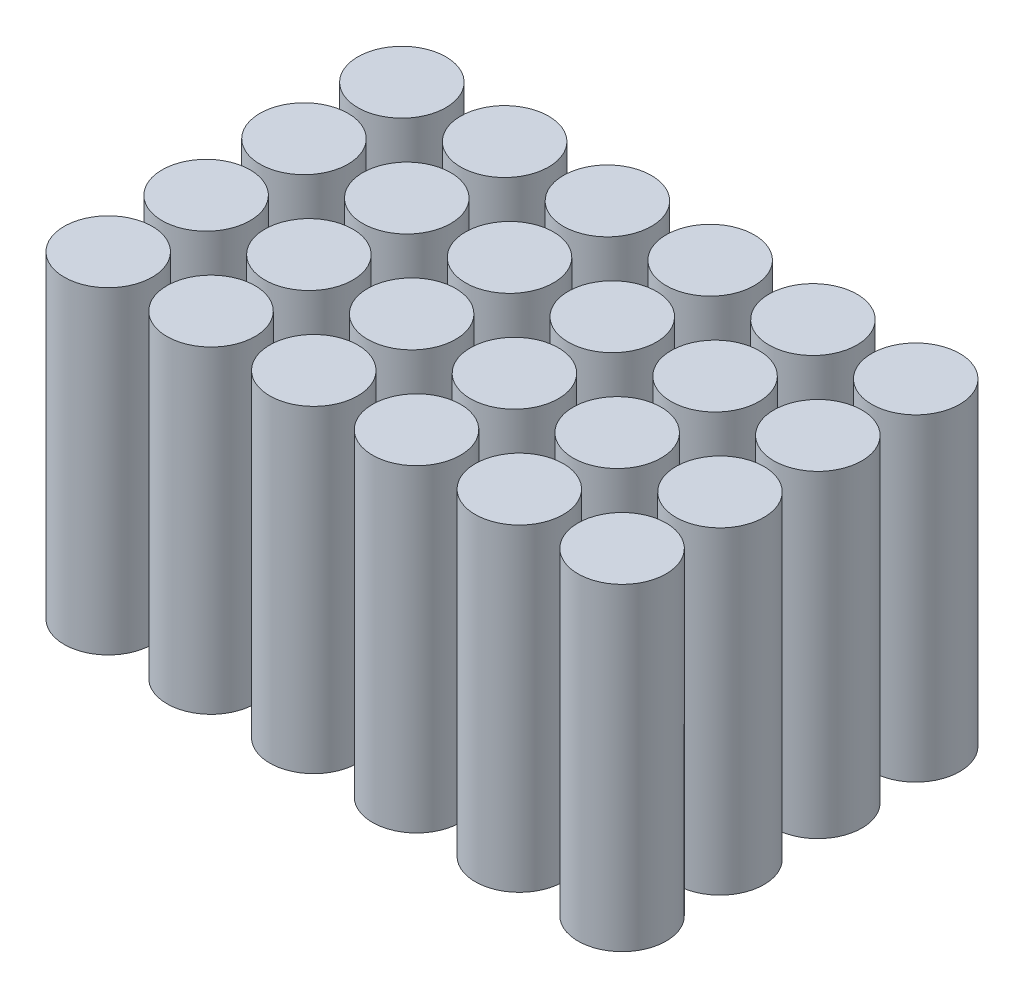
ISO-10303-21;
HEADER;
FILE_DESCRIPTION(('STEP AP214'),'2;1');
FILE_NAME('part.step','',(''),(''),'','','');
FILE_SCHEMA(('AUTOMOTIVE_DESIGN { 1 0 10303 214 1 1 1 1 }'));
ENDSEC;
DATA;
#1=APPLICATION_CONTEXT('core data for automotive mechanical design processes');
#2=APPLICATION_PROTOCOL_DEFINITION('international standard','automotive_design',2000,#1);
#3=PRODUCT_CONTEXT('',#1,'mechanical');
#4=PRODUCT('Part','Part','',(#3));
#5=PRODUCT_RELATED_PRODUCT_CATEGORY('part','',(#4));
#6=PRODUCT_DEFINITION_FORMATION('','',#4);
#7=PRODUCT_DEFINITION_CONTEXT('part definition',#1,'design');
#8=PRODUCT_DEFINITION('design','',#6,#7);
#9=PRODUCT_DEFINITION_SHAPE('','',#8);
#10=(LENGTH_UNIT() NAMED_UNIT(*) SI_UNIT(.MILLI.,.METRE.));
#11=(NAMED_UNIT(*) PLANE_ANGLE_UNIT() SI_UNIT($,.RADIAN.));
#12=(NAMED_UNIT(*) SI_UNIT($,.STERADIAN.) SOLID_ANGLE_UNIT());
#13=UNCERTAINTY_MEASURE_WITH_UNIT(LENGTH_MEASURE(1.E-05),#10,'distance_accuracy_value','');
#14=(GEOMETRIC_REPRESENTATION_CONTEXT(3) GLOBAL_UNCERTAINTY_ASSIGNED_CONTEXT((#13)) GLOBAL_UNIT_ASSIGNED_CONTEXT((#10,
#11,#12)) REPRESENTATION_CONTEXT('',''));
#15=CARTESIAN_POINT('',(0.,0.,0.));
#16=DIRECTION('',(0.,0.,1.));
#17=DIRECTION('',(1.,0.,0.));
#18=AXIS2_PLACEMENT_3D('',#15,#16,#17);
#19=CARTESIAN_POINT('',(-31.4999999999999,65.,-29.9999999999999));
#20=DIRECTION('',(0.,-1.,0.));
#21=DIRECTION('',(0.,0.,-1.));
#22=AXIS2_PLACEMENT_3D('',#19,#20,#21);
#23=CYLINDRICAL_SURFACE('',#22,9.00000000000001);
#24=CARTESIAN_POINT('',(-31.4999999999999,65.,-29.9999999999999));
#25=DIRECTION('',(0.,1.,0.));
#26=DIRECTION('',(0.,0.,-1.));
#27=AXIS2_PLACEMENT_3D('',#24,#25,#26);
#28=CIRCLE('',#27,9.00000000000001);
#29=CARTESIAN_POINT('',(-31.4999999999999,65.,-39.));
#30=VERTEX_POINT('',#29);
#31=EDGE_CURVE('E60',#30,#30,#28,.T.);
#32=ORIENTED_EDGE('',*,*,#31,.F.);
#33=EDGE_LOOP('',(#32));
#34=FACE_BOUND('',#33,.T.);
#35=CARTESIAN_POINT('',(-31.4999999999999,0.,-29.9999999999999));
#36=DIRECTION('',(0.,1.,0.));
#37=DIRECTION('',(0.,0.,-1.));
#38=AXIS2_PLACEMENT_3D('',#35,#36,#37);
#39=CIRCLE('',#38,9.00000000000001);
#40=CARTESIAN_POINT('',(-31.4999999999999,0.,-39.));
#41=VERTEX_POINT('',#40);
#42=EDGE_CURVE('E11',#41,#41,#39,.T.);
#43=ORIENTED_EDGE('',*,*,#42,.T.);
#44=EDGE_LOOP('',(#43));
#45=FACE_BOUND('',#44,.T.);
#46=ADVANCED_FACE('F56',(#34,#45),#23,.T.);
#47=CARTESIAN_POINT('',(-31.4999999999999,65.,-29.9999999999999));
#48=DIRECTION('',(0.,-1.,0.));
#49=DIRECTION('',(0.,0.,-1.));
#50=AXIS2_PLACEMENT_3D('',#47,#48,#49);
#51=PLANE('',#50);
#52=ORIENTED_EDGE('',*,*,#31,.T.);
#53=EDGE_LOOP('',(#52));
#54=FACE_BOUND('',#53,.T.);
#55=ADVANCED_FACE('F58',(#54),#51,.F.);
#56=CARTESIAN_POINT('',(-31.4999999999999,0.,-29.9999999999999));
#57=DIRECTION('',(0.,-1.,0.));
#58=DIRECTION('',(0.,0.,-1.));
#59=AXIS2_PLACEMENT_3D('',#56,#57,#58);
#60=PLANE('',#59);
#61=ORIENTED_EDGE('',*,*,#42,.F.);
#62=EDGE_LOOP('',(#61));
#63=FACE_BOUND('',#62,.T.);
#64=ADVANCED_FACE('F75',(#63),#60,.T.);
#65=CLOSED_SHELL('',(#46,#55,#64));
#66=MANIFOLD_SOLID_BREP('B2',#65);
#67=CARTESIAN_POINT('',(-31.4999999999999,65.,-9.99999999999997));
#68=DIRECTION('',(0.,-1.,0.));
#69=DIRECTION('',(0.,0.,-1.));
#70=AXIS2_PLACEMENT_3D('',#67,#68,#69);
#71=CYLINDRICAL_SURFACE('',#70,9.);
#72=CARTESIAN_POINT('',(-31.4999999999999,65.,-9.99999999999997));
#73=DIRECTION('',(0.,1.,0.));
#74=DIRECTION('',(0.,0.,-1.));
#75=AXIS2_PLACEMENT_3D('',#72,#73,#74);
#76=CIRCLE('',#75,9.);
#77=CARTESIAN_POINT('',(-31.4999999999999,65.,-19.));
#78=VERTEX_POINT('',#77);
#79=EDGE_CURVE('E122',#78,#78,#76,.T.);
#80=ORIENTED_EDGE('',*,*,#79,.F.);
#81=EDGE_LOOP('',(#80));
#82=FACE_BOUND('',#81,.T.);
#83=CARTESIAN_POINT('',(-31.4999999999999,0.,-9.99999999999997));
#84=DIRECTION('',(0.,1.,0.));
#85=DIRECTION('',(0.,0.,-1.));
#86=AXIS2_PLACEMENT_3D('',#83,#84,#85);
#87=CIRCLE('',#86,9.);
#88=CARTESIAN_POINT('',(-31.4999999999999,0.,-19.));
#89=VERTEX_POINT('',#88);
#90=EDGE_CURVE('E55',#89,#89,#87,.T.);
#91=ORIENTED_EDGE('',*,*,#90,.T.);
#92=EDGE_LOOP('',(#91));
#93=FACE_BOUND('',#92,.T.);
#94=ADVANCED_FACE('F118',(#82,#93),#71,.T.);
#95=CARTESIAN_POINT('',(-31.4999999999999,65.,-9.99999999999997));
#96=DIRECTION('',(0.,-1.,0.));
#97=DIRECTION('',(0.,0.,-1.));
#98=AXIS2_PLACEMENT_3D('',#95,#96,#97);
#99=PLANE('',#98);
#100=ORIENTED_EDGE('',*,*,#79,.T.);
#101=EDGE_LOOP('',(#100));
#102=FACE_BOUND('',#101,.T.);
#103=ADVANCED_FACE('F120',(#102),#99,.F.);
#104=CARTESIAN_POINT('',(-31.4999999999999,0.,-9.99999999999997));
#105=DIRECTION('',(0.,-1.,0.));
#106=DIRECTION('',(0.,0.,-1.));
#107=AXIS2_PLACEMENT_3D('',#104,#105,#106);
#108=PLANE('',#107);
#109=ORIENTED_EDGE('',*,*,#90,.F.);
#110=EDGE_LOOP('',(#109));
#111=FACE_BOUND('',#110,.T.);
#112=ADVANCED_FACE('F137',(#111),#108,.T.);
#113=CLOSED_SHELL('',(#94,#103,#112));
#114=MANIFOLD_SOLID_BREP('B6',#113);
#115=CARTESIAN_POINT('',(-31.5,65.,10.));
#116=DIRECTION('',(0.,-1.,0.));
#117=DIRECTION('',(0.,0.,-1.));
#118=AXIS2_PLACEMENT_3D('',#115,#116,#117);
#119=CYLINDRICAL_SURFACE('',#118,9.);
#120=CARTESIAN_POINT('',(-31.5,65.,10.));
#121=DIRECTION('',(0.,1.,0.));
#122=DIRECTION('',(0.,0.,-1.));
#123=AXIS2_PLACEMENT_3D('',#120,#121,#122);
#124=CIRCLE('',#123,9.);
#125=CARTESIAN_POINT('',(-31.5,65.,1.00000000000001));
#126=VERTEX_POINT('',#125);
#127=EDGE_CURVE('E184',#126,#126,#124,.T.);
#128=ORIENTED_EDGE('',*,*,#127,.F.);
#129=EDGE_LOOP('',(#128));
#130=FACE_BOUND('',#129,.T.);
#131=CARTESIAN_POINT('',(-31.5,0.,10.));
#132=DIRECTION('',(0.,1.,0.));
#133=DIRECTION('',(0.,0.,-1.));
#134=AXIS2_PLACEMENT_3D('',#131,#132,#133);
#135=CIRCLE('',#134,9.);
#136=CARTESIAN_POINT('',(-31.5,0.,1.00000000000001));
#137=VERTEX_POINT('',#136);
#138=EDGE_CURVE('E117',#137,#137,#135,.T.);
#139=ORIENTED_EDGE('',*,*,#138,.T.);
#140=EDGE_LOOP('',(#139));
#141=FACE_BOUND('',#140,.T.);
#142=ADVANCED_FACE('F180',(#130,#141),#119,.T.);
#143=CARTESIAN_POINT('',(-31.5,65.,10.));
#144=DIRECTION('',(0.,-1.,0.));
#145=DIRECTION('',(0.,0.,-1.));
#146=AXIS2_PLACEMENT_3D('',#143,#144,#145);
#147=PLANE('',#146);
#148=ORIENTED_EDGE('',*,*,#127,.T.);
#149=EDGE_LOOP('',(#148));
#150=FACE_BOUND('',#149,.T.);
#151=ADVANCED_FACE('F182',(#150),#147,.F.);
#152=CARTESIAN_POINT('',(-31.5,0.,10.));
#153=DIRECTION('',(0.,-1.,0.));
#154=DIRECTION('',(0.,0.,-1.));
#155=AXIS2_PLACEMENT_3D('',#152,#153,#154);
#156=PLANE('',#155);
#157=ORIENTED_EDGE('',*,*,#138,.F.);
#158=EDGE_LOOP('',(#157));
#159=FACE_BOUND('',#158,.T.);
#160=ADVANCED_FACE('F199',(#159),#156,.T.);
#161=CLOSED_SHELL('',(#142,#151,#160));
#162=MANIFOLD_SOLID_BREP('B50',#161);
#163=CARTESIAN_POINT('',(-31.4999999999999,65.,30.));
#164=DIRECTION('',(0.,-1.,0.));
#165=DIRECTION('',(0.,0.,-1.));
#166=AXIS2_PLACEMENT_3D('',#163,#164,#165);
#167=CYLINDRICAL_SURFACE('',#166,9.);
#168=CARTESIAN_POINT('',(-31.4999999999999,65.,30.));
#169=DIRECTION('',(0.,1.,0.));
#170=DIRECTION('',(0.,0.,1.));
#171=AXIS2_PLACEMENT_3D('',#168,#169,#170);
#172=CIRCLE('',#171,9.);
#173=CARTESIAN_POINT('',(-31.4999999999999,65.,39.));
#174=VERTEX_POINT('',#173);
#175=EDGE_CURVE('E246',#174,#174,#172,.T.);
#176=ORIENTED_EDGE('',*,*,#175,.F.);
#177=EDGE_LOOP('',(#176));
#178=FACE_BOUND('',#177,.T.);
#179=CARTESIAN_POINT('',(-31.4999999999999,0.,30.));
#180=DIRECTION('',(0.,1.,0.));
#181=DIRECTION('',(0.,0.,1.));
#182=AXIS2_PLACEMENT_3D('',#179,#180,#181);
#183=CIRCLE('',#182,9.);
#184=CARTESIAN_POINT('',(-31.4999999999999,0.,39.));
#185=VERTEX_POINT('',#184);
#186=EDGE_CURVE('E179',#185,#185,#183,.T.);
#187=ORIENTED_EDGE('',*,*,#186,.T.);
#188=EDGE_LOOP('',(#187));
#189=FACE_BOUND('',#188,.T.);
#190=ADVANCED_FACE('F242',(#178,#189),#167,.T.);
#191=CARTESIAN_POINT('',(-31.4999999999999,65.,30.));
#192=DIRECTION('',(0.,1.,0.));
#193=DIRECTION('',(0.,0.,1.));
#194=AXIS2_PLACEMENT_3D('',#191,#192,#193);
#195=PLANE('',#194);
#196=ORIENTED_EDGE('',*,*,#175,.T.);
#197=EDGE_LOOP('',(#196));
#198=FACE_BOUND('',#197,.T.);
#199=ADVANCED_FACE('F244',(#198),#195,.T.);
#200=CARTESIAN_POINT('',(-31.4999999999999,0.,30.));
#201=DIRECTION('',(0.,1.,0.));
#202=DIRECTION('',(0.,0.,1.));
#203=AXIS2_PLACEMENT_3D('',#200,#201,#202);
#204=PLANE('',#203);
#205=ORIENTED_EDGE('',*,*,#186,.F.);
#206=EDGE_LOOP('',(#205));
#207=FACE_BOUND('',#206,.T.);
#208=ADVANCED_FACE('F261',(#207),#204,.F.);
#209=CLOSED_SHELL('',(#190,#199,#208));
#210=MANIFOLD_SOLID_BREP('B112',#209);
#211=CARTESIAN_POINT('',(-52.4999999999999,65.,-29.9999999999999));
#212=DIRECTION('',(0.,-1.,0.));
#213=DIRECTION('',(0.,0.,-1.));
#214=AXIS2_PLACEMENT_3D('',#211,#212,#213);
#215=CYLINDRICAL_SURFACE('',#214,9.);
#216=CARTESIAN_POINT('',(-52.4999999999999,65.,-29.9999999999999));
#217=DIRECTION('',(0.,1.,0.));
#218=DIRECTION('',(0.,0.,-1.));
#219=AXIS2_PLACEMENT_3D('',#216,#217,#218);
#220=CIRCLE('',#219,9.);
#221=CARTESIAN_POINT('',(-52.4999999999999,65.,-38.9999999999999));
#222=VERTEX_POINT('',#221);
#223=EDGE_CURVE('E308',#222,#222,#220,.T.);
#224=ORIENTED_EDGE('',*,*,#223,.F.);
#225=EDGE_LOOP('',(#224));
#226=FACE_BOUND('',#225,.T.);
#227=CARTESIAN_POINT('',(-52.4999999999999,0.,-29.9999999999999));
#228=DIRECTION('',(0.,1.,0.));
#229=DIRECTION('',(0.,0.,-1.));
#230=AXIS2_PLACEMENT_3D('',#227,#228,#229);
#231=CIRCLE('',#230,9.);
#232=CARTESIAN_POINT('',(-52.4999999999999,0.,-38.9999999999999));
#233=VERTEX_POINT('',#232);
#234=EDGE_CURVE('E241',#233,#233,#231,.T.);
#235=ORIENTED_EDGE('',*,*,#234,.T.);
#236=EDGE_LOOP('',(#235));
#237=FACE_BOUND('',#236,.T.);
#238=ADVANCED_FACE('F304',(#226,#237),#215,.T.);
#239=CARTESIAN_POINT('',(-52.4999999999999,65.,-29.9999999999999));
#240=DIRECTION('',(0.,-1.,0.));
#241=DIRECTION('',(0.,0.,-1.));
#242=AXIS2_PLACEMENT_3D('',#239,#240,#241);
#243=PLANE('',#242);
#244=ORIENTED_EDGE('',*,*,#223,.T.);
#245=EDGE_LOOP('',(#244));
#246=FACE_BOUND('',#245,.T.);
#247=ADVANCED_FACE('F306',(#246),#243,.F.);
#248=CARTESIAN_POINT('',(-52.4999999999999,0.,-29.9999999999999));
#249=DIRECTION('',(0.,-1.,0.));
#250=DIRECTION('',(0.,0.,-1.));
#251=AXIS2_PLACEMENT_3D('',#248,#249,#250);
#252=PLANE('',#251);
#253=ORIENTED_EDGE('',*,*,#234,.F.);
#254=EDGE_LOOP('',(#253));
#255=FACE_BOUND('',#254,.T.);
#256=ADVANCED_FACE('F323',(#255),#252,.T.);
#257=CLOSED_SHELL('',(#238,#247,#256));
#258=MANIFOLD_SOLID_BREP('B174',#257);
#259=CARTESIAN_POINT('',(-52.4999999999999,65.,-9.99999999999997));
#260=DIRECTION('',(0.,-1.,0.));
#261=DIRECTION('',(0.,0.,-1.));
#262=AXIS2_PLACEMENT_3D('',#259,#260,#261);
#263=CYLINDRICAL_SURFACE('',#262,9.);
#264=CARTESIAN_POINT('',(-52.4999999999999,65.,-9.99999999999997));
#265=DIRECTION('',(0.,1.,0.));
#266=DIRECTION('',(0.,0.,-1.));
#267=AXIS2_PLACEMENT_3D('',#264,#265,#266);
#268=CIRCLE('',#267,9.);
#269=CARTESIAN_POINT('',(-52.4999999999999,65.,-19.));
#270=VERTEX_POINT('',#269);
#271=EDGE_CURVE('E370',#270,#270,#268,.T.);
#272=ORIENTED_EDGE('',*,*,#271,.F.);
#273=EDGE_LOOP('',(#272));
#274=FACE_BOUND('',#273,.T.);
#275=CARTESIAN_POINT('',(-52.4999999999999,0.,-9.99999999999997));
#276=DIRECTION('',(0.,1.,0.));
#277=DIRECTION('',(0.,0.,-1.));
#278=AXIS2_PLACEMENT_3D('',#275,#276,#277);
#279=CIRCLE('',#278,9.);
#280=CARTESIAN_POINT('',(-52.4999999999999,0.,-19.));
#281=VERTEX_POINT('',#280);
#282=EDGE_CURVE('E303',#281,#281,#279,.T.);
#283=ORIENTED_EDGE('',*,*,#282,.T.);
#284=EDGE_LOOP('',(#283));
#285=FACE_BOUND('',#284,.T.);
#286=ADVANCED_FACE('F366',(#274,#285),#263,.T.);
#287=CARTESIAN_POINT('',(-52.4999999999999,65.,-9.99999999999997));
#288=DIRECTION('',(0.,-1.,0.));
#289=DIRECTION('',(0.,0.,-1.));
#290=AXIS2_PLACEMENT_3D('',#287,#288,#289);
#291=PLANE('',#290);
#292=ORIENTED_EDGE('',*,*,#271,.T.);
#293=EDGE_LOOP('',(#292));
#294=FACE_BOUND('',#293,.T.);
#295=ADVANCED_FACE('F368',(#294),#291,.F.);
#296=CARTESIAN_POINT('',(-52.4999999999999,0.,-9.99999999999997));
#297=DIRECTION('',(0.,-1.,0.));
#298=DIRECTION('',(0.,0.,-1.));
#299=AXIS2_PLACEMENT_3D('',#296,#297,#298);
#300=PLANE('',#299);
#301=ORIENTED_EDGE('',*,*,#282,.F.);
#302=EDGE_LOOP('',(#301));
#303=FACE_BOUND('',#302,.T.);
#304=ADVANCED_FACE('F385',(#303),#300,.T.);
#305=CLOSED_SHELL('',(#286,#295,#304));
#306=MANIFOLD_SOLID_BREP('B236',#305);
#307=CARTESIAN_POINT('',(-52.5,65.,10.));
#308=DIRECTION('',(0.,-1.,0.));
#309=DIRECTION('',(0.,0.,-1.));
#310=AXIS2_PLACEMENT_3D('',#307,#308,#309);
#311=CYLINDRICAL_SURFACE('',#310,9.);
#312=CARTESIAN_POINT('',(-52.5,65.,10.));
#313=DIRECTION('',(0.,1.,0.));
#314=DIRECTION('',(0.,0.,-1.));
#315=AXIS2_PLACEMENT_3D('',#312,#313,#314);
#316=CIRCLE('',#315,9.);
#317=CARTESIAN_POINT('',(-52.5,65.,1.00000000000002));
#318=VERTEX_POINT('',#317);
#319=EDGE_CURVE('E432',#318,#318,#316,.T.);
#320=ORIENTED_EDGE('',*,*,#319,.F.);
#321=EDGE_LOOP('',(#320));
#322=FACE_BOUND('',#321,.T.);
#323=CARTESIAN_POINT('',(-52.5,0.,10.));
#324=DIRECTION('',(0.,1.,0.));
#325=DIRECTION('',(0.,0.,-1.));
#326=AXIS2_PLACEMENT_3D('',#323,#324,#325);
#327=CIRCLE('',#326,9.);
#328=CARTESIAN_POINT('',(-52.5,0.,1.00000000000002));
#329=VERTEX_POINT('',#328);
#330=EDGE_CURVE('E365',#329,#329,#327,.T.);
#331=ORIENTED_EDGE('',*,*,#330,.T.);
#332=EDGE_LOOP('',(#331));
#333=FACE_BOUND('',#332,.T.);
#334=ADVANCED_FACE('F428',(#322,#333),#311,.T.);
#335=CARTESIAN_POINT('',(-52.5,65.,10.));
#336=DIRECTION('',(0.,-1.,0.));
#337=DIRECTION('',(0.,0.,-1.));
#338=AXIS2_PLACEMENT_3D('',#335,#336,#337);
#339=PLANE('',#338);
#340=ORIENTED_EDGE('',*,*,#319,.T.);
#341=EDGE_LOOP('',(#340));
#342=FACE_BOUND('',#341,.T.);
#343=ADVANCED_FACE('F430',(#342),#339,.F.);
#344=CARTESIAN_POINT('',(-52.5,0.,10.));
#345=DIRECTION('',(0.,-1.,0.));
#346=DIRECTION('',(0.,0.,-1.));
#347=AXIS2_PLACEMENT_3D('',#344,#345,#346);
#348=PLANE('',#347);
#349=ORIENTED_EDGE('',*,*,#330,.F.);
#350=EDGE_LOOP('',(#349));
#351=FACE_BOUND('',#350,.T.);
#352=ADVANCED_FACE('F447',(#351),#348,.T.);
#353=CLOSED_SHELL('',(#334,#343,#352));
#354=MANIFOLD_SOLID_BREP('B298',#353);
#355=CARTESIAN_POINT('',(-52.4999999999999,65.,30.));
#356=DIRECTION('',(0.,-1.,0.));
#357=DIRECTION('',(0.,0.,-1.));
#358=AXIS2_PLACEMENT_3D('',#355,#356,#357);
#359=CYLINDRICAL_SURFACE('',#358,9.);
#360=CARTESIAN_POINT('',(-52.4999999999999,65.,30.));
#361=DIRECTION('',(0.,1.,0.));
#362=DIRECTION('',(0.,0.,1.));
#363=AXIS2_PLACEMENT_3D('',#360,#361,#362);
#364=CIRCLE('',#363,9.);
#365=CARTESIAN_POINT('',(-52.4999999999999,65.,39.));
#366=VERTEX_POINT('',#365);
#367=EDGE_CURVE('E494',#366,#366,#364,.T.);
#368=ORIENTED_EDGE('',*,*,#367,.F.);
#369=EDGE_LOOP('',(#368));
#370=FACE_BOUND('',#369,.T.);
#371=CARTESIAN_POINT('',(-52.4999999999999,0.,30.));
#372=DIRECTION('',(0.,1.,0.));
#373=DIRECTION('',(0.,0.,1.));
#374=AXIS2_PLACEMENT_3D('',#371,#372,#373);
#375=CIRCLE('',#374,9.);
#376=CARTESIAN_POINT('',(-52.4999999999999,0.,39.));
#377=VERTEX_POINT('',#376);
#378=EDGE_CURVE('E427',#377,#377,#375,.T.);
#379=ORIENTED_EDGE('',*,*,#378,.T.);
#380=EDGE_LOOP('',(#379));
#381=FACE_BOUND('',#380,.T.);
#382=ADVANCED_FACE('F490',(#370,#381),#359,.T.);
#383=CARTESIAN_POINT('',(-52.4999999999999,65.,30.));
#384=DIRECTION('',(0.,1.,0.));
#385=DIRECTION('',(0.,0.,1.));
#386=AXIS2_PLACEMENT_3D('',#383,#384,#385);
#387=PLANE('',#386);
#388=ORIENTED_EDGE('',*,*,#367,.T.);
#389=EDGE_LOOP('',(#388));
#390=FACE_BOUND('',#389,.T.);
#391=ADVANCED_FACE('F492',(#390),#387,.T.);
#392=CARTESIAN_POINT('',(-52.4999999999999,0.,30.));
#393=DIRECTION('',(0.,1.,0.));
#394=DIRECTION('',(0.,0.,1.));
#395=AXIS2_PLACEMENT_3D('',#392,#393,#394);
#396=PLANE('',#395);
#397=ORIENTED_EDGE('',*,*,#378,.F.);
#398=EDGE_LOOP('',(#397));
#399=FACE_BOUND('',#398,.T.);
#400=ADVANCED_FACE('F509',(#399),#396,.F.);
#401=CLOSED_SHELL('',(#382,#391,#400));
#402=MANIFOLD_SOLID_BREP('B360',#401);
#403=CARTESIAN_POINT('',(10.4999999999999,65.,30.));
#404=DIRECTION('',(0.,-1.,0.));
#405=DIRECTION('',(0.,0.,-1.));
#406=AXIS2_PLACEMENT_3D('',#403,#404,#405);
#407=CYLINDRICAL_SURFACE('',#406,9.00000000000001);
#408=CARTESIAN_POINT('',(10.4999999999999,65.,30.));
#409=DIRECTION('',(0.,1.,0.));
#410=DIRECTION('',(0.,0.,-1.));
#411=AXIS2_PLACEMENT_3D('',#408,#409,#410);
#412=CIRCLE('',#411,9.00000000000001);
#413=CARTESIAN_POINT('',(10.4999999999999,65.,21.));
#414=VERTEX_POINT('',#413);
#415=EDGE_CURVE('E556',#414,#414,#412,.T.);
#416=ORIENTED_EDGE('',*,*,#415,.F.);
#417=EDGE_LOOP('',(#416));
#418=FACE_BOUND('',#417,.T.);
#419=CARTESIAN_POINT('',(10.4999999999999,0.,30.));
#420=DIRECTION('',(0.,1.,0.));
#421=DIRECTION('',(0.,0.,-1.));
#422=AXIS2_PLACEMENT_3D('',#419,#420,#421);
#423=CIRCLE('',#422,9.00000000000001);
#424=CARTESIAN_POINT('',(10.4999999999999,0.,21.));
#425=VERTEX_POINT('',#424);
#426=EDGE_CURVE('E489',#425,#425,#423,.T.);
#427=ORIENTED_EDGE('',*,*,#426,.T.);
#428=EDGE_LOOP('',(#427));
#429=FACE_BOUND('',#428,.T.);
#430=ADVANCED_FACE('F552',(#418,#429),#407,.T.);
#431=CARTESIAN_POINT('',(10.4999999999999,65.,30.));
#432=DIRECTION('',(0.,-1.,0.));
#433=DIRECTION('',(0.,0.,-1.));
#434=AXIS2_PLACEMENT_3D('',#431,#432,#433);
#435=PLANE('',#434);
#436=ORIENTED_EDGE('',*,*,#415,.T.);
#437=EDGE_LOOP('',(#436));
#438=FACE_BOUND('',#437,.T.);
#439=ADVANCED_FACE('F554',(#438),#435,.F.);
#440=CARTESIAN_POINT('',(10.4999999999999,0.,30.));
#441=DIRECTION('',(0.,-1.,0.));
#442=DIRECTION('',(0.,0.,-1.));
#443=AXIS2_PLACEMENT_3D('',#440,#441,#442);
#444=PLANE('',#443);
#445=ORIENTED_EDGE('',*,*,#426,.F.);
#446=EDGE_LOOP('',(#445));
#447=FACE_BOUND('',#446,.T.);
#448=ADVANCED_FACE('F571',(#447),#444,.T.);
#449=CLOSED_SHELL('',(#430,#439,#448));
#450=MANIFOLD_SOLID_BREP('B422',#449);
#451=CARTESIAN_POINT('',(31.4999999999999,65.,30.));
#452=DIRECTION('',(0.,-1.,0.));
#453=DIRECTION('',(0.,0.,-1.));
#454=AXIS2_PLACEMENT_3D('',#451,#452,#453);
#455=CYLINDRICAL_SURFACE('',#454,9.00000000000001);
#456=CARTESIAN_POINT('',(31.4999999999999,65.,30.));
#457=DIRECTION('',(0.,1.,0.));
#458=DIRECTION('',(0.,0.,-1.));
#459=AXIS2_PLACEMENT_3D('',#456,#457,#458);
#460=CIRCLE('',#459,9.00000000000001);
#461=CARTESIAN_POINT('',(31.4999999999999,65.,21.));
#462=VERTEX_POINT('',#461);
#463=EDGE_CURVE('E619',#462,#462,#460,.T.);
#464=ORIENTED_EDGE('',*,*,#463,.F.);
#465=EDGE_LOOP('',(#464));
#466=FACE_BOUND('',#465,.T.);
#467=CARTESIAN_POINT('',(31.4999999999999,0.,30.));
#468=DIRECTION('',(0.,1.,0.));
#469=DIRECTION('',(0.,0.,-1.));
#470=AXIS2_PLACEMENT_3D('',#467,#468,#469);
#471=CIRCLE('',#470,9.00000000000001);
#472=CARTESIAN_POINT('',(31.4999999999999,0.,21.));
#473=VERTEX_POINT('',#472);
#474=EDGE_CURVE('E551',#473,#473,#471,.T.);
#475=ORIENTED_EDGE('',*,*,#474,.T.);
#476=EDGE_LOOP('',(#475));
#477=FACE_BOUND('',#476,.T.);
#478=ADVANCED_FACE('F615',(#466,#477),#455,.T.);
#479=CARTESIAN_POINT('',(31.4999999999999,65.,30.));
#480=DIRECTION('',(0.,-1.,0.));
#481=DIRECTION('',(0.,0.,-1.));
#482=AXIS2_PLACEMENT_3D('',#479,#480,#481);
#483=PLANE('',#482);
#484=ORIENTED_EDGE('',*,*,#463,.T.);
#485=EDGE_LOOP('',(#484));
#486=FACE_BOUND('',#485,.T.);
#487=ADVANCED_FACE('F617',(#486),#483,.F.);
#488=CARTESIAN_POINT('',(31.4999999999999,0.,30.));
#489=DIRECTION('',(0.,-1.,0.));
#490=DIRECTION('',(0.,0.,-1.));
#491=AXIS2_PLACEMENT_3D('',#488,#489,#490);
#492=PLANE('',#491);
#493=ORIENTED_EDGE('',*,*,#474,.F.);
#494=EDGE_LOOP('',(#493));
#495=FACE_BOUND('',#494,.T.);
#496=ADVANCED_FACE('F634',(#495),#492,.T.);
#497=CLOSED_SHELL('',(#478,#487,#496));
#498=MANIFOLD_SOLID_BREP('B484',#497);
#499=CARTESIAN_POINT('',(52.4999999999999,65.,30.));
#500=DIRECTION('',(0.,-1.,0.));
#501=DIRECTION('',(0.,0.,-1.));
#502=AXIS2_PLACEMENT_3D('',#499,#500,#501);
#503=CYLINDRICAL_SURFACE('',#502,9.);
#504=CARTESIAN_POINT('',(52.4999999999999,65.,30.));
#505=DIRECTION('',(0.,1.,0.));
#506=DIRECTION('',(0.,0.,-1.));
#507=AXIS2_PLACEMENT_3D('',#504,#505,#506);
#508=CIRCLE('',#507,9.);
#509=CARTESIAN_POINT('',(52.4999999999999,65.,21.));
#510=VERTEX_POINT('',#509);
#511=EDGE_CURVE('E682',#510,#510,#508,.T.);
#512=ORIENTED_EDGE('',*,*,#511,.F.);
#513=EDGE_LOOP('',(#512));
#514=FACE_BOUND('',#513,.T.);
#515=CARTESIAN_POINT('',(52.4999999999999,0.,30.));
#516=DIRECTION('',(0.,1.,0.));
#517=DIRECTION('',(0.,0.,-1.));
#518=AXIS2_PLACEMENT_3D('',#515,#516,#517);
#519=CIRCLE('',#518,9.);
#520=CARTESIAN_POINT('',(52.4999999999999,0.,21.));
#521=VERTEX_POINT('',#520);
#522=EDGE_CURVE('E614',#521,#521,#519,.T.);
#523=ORIENTED_EDGE('',*,*,#522,.T.);
#524=EDGE_LOOP('',(#523));
#525=FACE_BOUND('',#524,.T.);
#526=ADVANCED_FACE('F678',(#514,#525),#503,.T.);
#527=CARTESIAN_POINT('',(52.4999999999999,65.,30.));
#528=DIRECTION('',(0.,-1.,0.));
#529=DIRECTION('',(0.,0.,-1.));
#530=AXIS2_PLACEMENT_3D('',#527,#528,#529);
#531=PLANE('',#530);
#532=ORIENTED_EDGE('',*,*,#511,.T.);
#533=EDGE_LOOP('',(#532));
#534=FACE_BOUND('',#533,.T.);
#535=ADVANCED_FACE('F680',(#534),#531,.F.);
#536=CARTESIAN_POINT('',(52.4999999999999,0.,30.));
#537=DIRECTION('',(0.,-1.,0.));
#538=DIRECTION('',(0.,0.,-1.));
#539=AXIS2_PLACEMENT_3D('',#536,#537,#538);
#540=PLANE('',#539);
#541=ORIENTED_EDGE('',*,*,#522,.F.);
#542=EDGE_LOOP('',(#541));
#543=FACE_BOUND('',#542,.T.);
#544=ADVANCED_FACE('F698',(#543),#540,.T.);
#545=CLOSED_SHELL('',(#526,#535,#544));
#546=MANIFOLD_SOLID_BREP('B546',#545);
#547=CARTESIAN_POINT('',(-10.5000000000001,65.,-30.));
#548=DIRECTION('',(0.,-1.,0.));
#549=DIRECTION('',(0.,0.,-1.));
#550=AXIS2_PLACEMENT_3D('',#547,#548,#549);
#551=CYLINDRICAL_SURFACE('',#550,9.);
#552=CARTESIAN_POINT('',(-10.5000000000001,65.,-30.));
#553=DIRECTION('',(0.,1.,0.));
#554=DIRECTION('',(0.,0.,1.));
#555=AXIS2_PLACEMENT_3D('',#552,#553,#554);
#556=CIRCLE('',#555,9.);
#557=CARTESIAN_POINT('',(-10.5000000000001,65.,-21.));
#558=VERTEX_POINT('',#557);
#559=EDGE_CURVE('E745',#558,#558,#556,.T.);
#560=ORIENTED_EDGE('',*,*,#559,.F.);
#561=EDGE_LOOP('',(#560));
#562=FACE_BOUND('',#561,.T.);
#563=CARTESIAN_POINT('',(-10.5000000000001,0.,-30.));
#564=DIRECTION('',(0.,1.,0.));
#565=DIRECTION('',(0.,0.,1.));
#566=AXIS2_PLACEMENT_3D('',#563,#564,#565);
#567=CIRCLE('',#566,9.);
#568=CARTESIAN_POINT('',(-10.5000000000001,0.,-21.));
#569=VERTEX_POINT('',#568);
#570=EDGE_CURVE('E677',#569,#569,#567,.T.);
#571=ORIENTED_EDGE('',*,*,#570,.T.);
#572=EDGE_LOOP('',(#571));
#573=FACE_BOUND('',#572,.T.);
#574=ADVANCED_FACE('F741',(#562,#573),#551,.T.);
#575=CARTESIAN_POINT('',(-10.5000000000001,65.,-30.));
#576=DIRECTION('',(0.,1.,0.));
#577=DIRECTION('',(0.,0.,1.));
#578=AXIS2_PLACEMENT_3D('',#575,#576,#577);
#579=PLANE('',#578);
#580=ORIENTED_EDGE('',*,*,#559,.T.);
#581=EDGE_LOOP('',(#580));
#582=FACE_BOUND('',#581,.T.);
#583=ADVANCED_FACE('F743',(#582),#579,.T.);
#584=CARTESIAN_POINT('',(-10.5000000000001,0.,-30.));
#585=DIRECTION('',(0.,1.,0.));
#586=DIRECTION('',(0.,0.,1.));
#587=AXIS2_PLACEMENT_3D('',#584,#585,#586);
#588=PLANE('',#587);
#589=ORIENTED_EDGE('',*,*,#570,.F.);
#590=EDGE_LOOP('',(#589));
#591=FACE_BOUND('',#590,.T.);
#592=ADVANCED_FACE('F760',(#591),#588,.F.);
#593=CLOSED_SHELL('',(#574,#583,#592));
#594=MANIFOLD_SOLID_BREP('B609',#593);
#595=CARTESIAN_POINT('',(-10.5000000000001,65.,-10.));
#596=DIRECTION('',(0.,-1.,0.));
#597=DIRECTION('',(0.,0.,-1.));
#598=AXIS2_PLACEMENT_3D('',#595,#596,#597);
#599=CYLINDRICAL_SURFACE('',#598,9.);
#600=CARTESIAN_POINT('',(-10.5000000000001,65.,-10.));
#601=DIRECTION('',(0.,1.,0.));
#602=DIRECTION('',(0.,0.,1.));
#603=AXIS2_PLACEMENT_3D('',#600,#601,#602);
#604=CIRCLE('',#603,9.);
#605=CARTESIAN_POINT('',(-10.5000000000001,65.,-0.999999999999999));
#606=VERTEX_POINT('',#605);
#607=EDGE_CURVE('E807',#606,#606,#604,.T.);
#608=ORIENTED_EDGE('',*,*,#607,.F.);
#609=EDGE_LOOP('',(#608));
#610=FACE_BOUND('',#609,.T.);
#611=CARTESIAN_POINT('',(-10.5000000000001,0.,-10.));
#612=DIRECTION('',(0.,1.,0.));
#613=DIRECTION('',(0.,0.,1.));
#614=AXIS2_PLACEMENT_3D('',#611,#612,#613);
#615=CIRCLE('',#614,9.);
#616=CARTESIAN_POINT('',(-10.5000000000001,0.,-0.999999999999999));
#617=VERTEX_POINT('',#616);
#618=EDGE_CURVE('E740',#617,#617,#615,.T.);
#619=ORIENTED_EDGE('',*,*,#618,.T.);
#620=EDGE_LOOP('',(#619));
#621=FACE_BOUND('',#620,.T.);
#622=ADVANCED_FACE('F803',(#610,#621),#599,.T.);
#623=CARTESIAN_POINT('',(-10.5000000000001,65.,-10.));
#624=DIRECTION('',(0.,1.,0.));
#625=DIRECTION('',(0.,0.,1.));
#626=AXIS2_PLACEMENT_3D('',#623,#624,#625);
#627=PLANE('',#626);
#628=ORIENTED_EDGE('',*,*,#607,.T.);
#629=EDGE_LOOP('',(#628));
#630=FACE_BOUND('',#629,.T.);
#631=ADVANCED_FACE('F805',(#630),#627,.T.);
#632=CARTESIAN_POINT('',(-10.5000000000001,0.,-10.));
#633=DIRECTION('',(0.,1.,0.));
#634=DIRECTION('',(0.,0.,1.));
#635=AXIS2_PLACEMENT_3D('',#632,#633,#634);
#636=PLANE('',#635);
#637=ORIENTED_EDGE('',*,*,#618,.F.);
#638=EDGE_LOOP('',(#637));
#639=FACE_BOUND('',#638,.T.);
#640=ADVANCED_FACE('F822',(#639),#636,.F.);
#641=CLOSED_SHELL('',(#622,#631,#640));
#642=MANIFOLD_SOLID_BREP('B672',#641);
#643=CARTESIAN_POINT('',(52.4999999999999,65.,-30.));
#644=DIRECTION('',(0.,-1.,0.));
#645=DIRECTION('',(0.,0.,-1.));
#646=AXIS2_PLACEMENT_3D('',#643,#644,#645);
#647=CYLINDRICAL_SURFACE('',#646,9.);
#648=CARTESIAN_POINT('',(52.4999999999999,65.,-30.));
#649=DIRECTION('',(0.,1.,0.));
#650=DIRECTION('',(0.,0.,1.));
#651=AXIS2_PLACEMENT_3D('',#648,#649,#650);
#652=CIRCLE('',#651,9.);
#653=CARTESIAN_POINT('',(52.4999999999999,65.,-21.));
#654=VERTEX_POINT('',#653);
#655=EDGE_CURVE('E869',#654,#654,#652,.T.);
#656=ORIENTED_EDGE('',*,*,#655,.F.);
#657=EDGE_LOOP('',(#656));
#658=FACE_BOUND('',#657,.T.);
#659=CARTESIAN_POINT('',(52.4999999999999,0.,-30.));
#660=DIRECTION('',(0.,1.,0.));
#661=DIRECTION('',(0.,0.,1.));
#662=AXIS2_PLACEMENT_3D('',#659,#660,#661);
#663=CIRCLE('',#662,9.);
#664=CARTESIAN_POINT('',(52.4999999999999,0.,-21.));
#665=VERTEX_POINT('',#664);
#666=EDGE_CURVE('E802',#665,#665,#663,.T.);
#667=ORIENTED_EDGE('',*,*,#666,.T.);
#668=EDGE_LOOP('',(#667));
#669=FACE_BOUND('',#668,.T.);
#670=ADVANCED_FACE('F865',(#658,#669),#647,.T.);
#671=CARTESIAN_POINT('',(52.4999999999999,65.,-30.));
#672=DIRECTION('',(0.,1.,0.));
#673=DIRECTION('',(0.,0.,1.));
#674=AXIS2_PLACEMENT_3D('',#671,#672,#673);
#675=PLANE('',#674);
#676=ORIENTED_EDGE('',*,*,#655,.T.);
#677=EDGE_LOOP('',(#676));
#678=FACE_BOUND('',#677,.T.);
#679=ADVANCED_FACE('F867',(#678),#675,.T.);
#680=CARTESIAN_POINT('',(52.4999999999999,0.,-30.));
#681=DIRECTION('',(0.,1.,0.));
#682=DIRECTION('',(0.,0.,1.));
#683=AXIS2_PLACEMENT_3D('',#680,#681,#682);
#684=PLANE('',#683);
#685=ORIENTED_EDGE('',*,*,#666,.F.);
#686=EDGE_LOOP('',(#685));
#687=FACE_BOUND('',#686,.T.);
#688=ADVANCED_FACE('F884',(#687),#684,.F.);
#689=CLOSED_SHELL('',(#670,#679,#688));
#690=MANIFOLD_SOLID_BREP('B735',#689);
#691=CARTESIAN_POINT('',(31.4999999999999,65.,-30.));
#692=DIRECTION('',(0.,-1.,0.));
#693=DIRECTION('',(0.,0.,-1.));
#694=AXIS2_PLACEMENT_3D('',#691,#692,#693);
#695=CYLINDRICAL_SURFACE('',#694,9.00000000000001);
#696=CARTESIAN_POINT('',(31.4999999999999,65.,-30.));
#697=DIRECTION('',(0.,1.,0.));
#698=DIRECTION('',(0.,0.,1.));
#699=AXIS2_PLACEMENT_3D('',#696,#697,#698);
#700=CIRCLE('',#699,9.00000000000001);
#701=CARTESIAN_POINT('',(31.4999999999999,65.,-21.));
#702=VERTEX_POINT('',#701);
#703=EDGE_CURVE('E931',#702,#702,#700,.T.);
#704=ORIENTED_EDGE('',*,*,#703,.F.);
#705=EDGE_LOOP('',(#704));
#706=FACE_BOUND('',#705,.T.);
#707=CARTESIAN_POINT('',(31.4999999999999,0.,-30.));
#708=DIRECTION('',(0.,1.,0.));
#709=DIRECTION('',(0.,0.,1.));
#710=AXIS2_PLACEMENT_3D('',#707,#708,#709);
#711=CIRCLE('',#710,9.00000000000001);
#712=CARTESIAN_POINT('',(31.4999999999999,0.,-21.));
#713=VERTEX_POINT('',#712);
#714=EDGE_CURVE('E864',#713,#713,#711,.T.);
#715=ORIENTED_EDGE('',*,*,#714,.T.);
#716=EDGE_LOOP('',(#715));
#717=FACE_BOUND('',#716,.T.);
#718=ADVANCED_FACE('F927',(#706,#717),#695,.T.);
#719=CARTESIAN_POINT('',(31.4999999999999,65.,-30.));
#720=DIRECTION('',(0.,1.,0.));
#721=DIRECTION('',(0.,0.,1.));
#722=AXIS2_PLACEMENT_3D('',#719,#720,#721);
#723=PLANE('',#722);
#724=ORIENTED_EDGE('',*,*,#703,.T.);
#725=EDGE_LOOP('',(#724));
#726=FACE_BOUND('',#725,.T.);
#727=ADVANCED_FACE('F929',(#726),#723,.T.);
#728=CARTESIAN_POINT('',(31.4999999999999,0.,-30.));
#729=DIRECTION('',(0.,1.,0.));
#730=DIRECTION('',(0.,0.,1.));
#731=AXIS2_PLACEMENT_3D('',#728,#729,#730);
#732=PLANE('',#731);
#733=ORIENTED_EDGE('',*,*,#714,.F.);
#734=EDGE_LOOP('',(#733));
#735=FACE_BOUND('',#734,.T.);
#736=ADVANCED_FACE('F946',(#735),#732,.F.);
#737=CLOSED_SHELL('',(#718,#727,#736));
#738=MANIFOLD_SOLID_BREP('B797',#737);
#739=CARTESIAN_POINT('',(10.4999999999999,65.,-30.));
#740=DIRECTION('',(0.,-1.,0.));
#741=DIRECTION('',(0.,0.,-1.));
#742=AXIS2_PLACEMENT_3D('',#739,#740,#741);
#743=CYLINDRICAL_SURFACE('',#742,9.00000000000001);
#744=CARTESIAN_POINT('',(10.4999999999999,65.,-30.));
#745=DIRECTION('',(0.,1.,0.));
#746=DIRECTION('',(0.,0.,1.));
#747=AXIS2_PLACEMENT_3D('',#744,#745,#746);
#748=CIRCLE('',#747,9.00000000000001);
#749=CARTESIAN_POINT('',(10.4999999999999,65.,-21.));
#750=VERTEX_POINT('',#749);
#751=EDGE_CURVE('E993',#750,#750,#748,.T.);
#752=ORIENTED_EDGE('',*,*,#751,.F.);
#753=EDGE_LOOP('',(#752));
#754=FACE_BOUND('',#753,.T.);
#755=CARTESIAN_POINT('',(10.4999999999999,0.,-30.));
#756=DIRECTION('',(0.,1.,0.));
#757=DIRECTION('',(0.,0.,1.));
#758=AXIS2_PLACEMENT_3D('',#755,#756,#757);
#759=CIRCLE('',#758,9.00000000000001);
#760=CARTESIAN_POINT('',(10.4999999999999,0.,-21.));
#761=VERTEX_POINT('',#760);
#762=EDGE_CURVE('E926',#761,#761,#759,.T.);
#763=ORIENTED_EDGE('',*,*,#762,.T.);
#764=EDGE_LOOP('',(#763));
#765=FACE_BOUND('',#764,.T.);
#766=ADVANCED_FACE('F989',(#754,#765),#743,.T.);
#767=CARTESIAN_POINT('',(10.4999999999999,65.,-30.));
#768=DIRECTION('',(0.,1.,0.));
#769=DIRECTION('',(0.,0.,1.));
#770=AXIS2_PLACEMENT_3D('',#767,#768,#769);
#771=PLANE('',#770);
#772=ORIENTED_EDGE('',*,*,#751,.T.);
#773=EDGE_LOOP('',(#772));
#774=FACE_BOUND('',#773,.T.);
#775=ADVANCED_FACE('F991',(#774),#771,.T.);
#776=CARTESIAN_POINT('',(10.4999999999999,0.,-30.));
#777=DIRECTION('',(0.,1.,0.));
#778=DIRECTION('',(0.,0.,1.));
#779=AXIS2_PLACEMENT_3D('',#776,#777,#778);
#780=PLANE('',#779);
#781=ORIENTED_EDGE('',*,*,#762,.F.);
#782=EDGE_LOOP('',(#781));
#783=FACE_BOUND('',#782,.T.);
#784=ADVANCED_FACE('F1008',(#783),#780,.F.);
#785=CLOSED_SHELL('',(#766,#775,#784));
#786=MANIFOLD_SOLID_BREP('B859',#785);
#787=CARTESIAN_POINT('',(52.4999999999999,65.,-10.));
#788=DIRECTION('',(0.,-1.,0.));
#789=DIRECTION('',(0.,0.,-1.));
#790=AXIS2_PLACEMENT_3D('',#787,#788,#789);
#791=CYLINDRICAL_SURFACE('',#790,9.);
#792=CARTESIAN_POINT('',(52.4999999999999,65.,-10.));
#793=DIRECTION('',(0.,1.,0.));
#794=DIRECTION('',(0.,0.,1.));
#795=AXIS2_PLACEMENT_3D('',#792,#793,#794);
#796=CIRCLE('',#795,9.);
#797=CARTESIAN_POINT('',(52.4999999999999,65.,-1.00000000000001));
#798=VERTEX_POINT('',#797);
#799=EDGE_CURVE('E1055',#798,#798,#796,.T.);
#800=ORIENTED_EDGE('',*,*,#799,.F.);
#801=EDGE_LOOP('',(#800));
#802=FACE_BOUND('',#801,.T.);
#803=CARTESIAN_POINT('',(52.4999999999999,0.,-10.));
#804=DIRECTION('',(0.,1.,0.));
#805=DIRECTION('',(0.,0.,1.));
#806=AXIS2_PLACEMENT_3D('',#803,#804,#805);
#807=CIRCLE('',#806,9.);
#808=CARTESIAN_POINT('',(52.4999999999999,0.,-1.00000000000001));
#809=VERTEX_POINT('',#808);
#810=EDGE_CURVE('E988',#809,#809,#807,.T.);
#811=ORIENTED_EDGE('',*,*,#810,.T.);
#812=EDGE_LOOP('',(#811));
#813=FACE_BOUND('',#812,.T.);
#814=ADVANCED_FACE('F1051',(#802,#813),#791,.T.);
#815=CARTESIAN_POINT('',(52.4999999999999,65.,-10.));
#816=DIRECTION('',(0.,1.,0.));
#817=DIRECTION('',(0.,0.,1.));
#818=AXIS2_PLACEMENT_3D('',#815,#816,#817);
#819=PLANE('',#818);
#820=ORIENTED_EDGE('',*,*,#799,.T.);
#821=EDGE_LOOP('',(#820));
#822=FACE_BOUND('',#821,.T.);
#823=ADVANCED_FACE('F1053',(#822),#819,.T.);
#824=CARTESIAN_POINT('',(52.4999999999999,0.,-10.));
#825=DIRECTION('',(0.,1.,0.));
#826=DIRECTION('',(0.,0.,1.));
#827=AXIS2_PLACEMENT_3D('',#824,#825,#826);
#828=PLANE('',#827);
#829=ORIENTED_EDGE('',*,*,#810,.F.);
#830=EDGE_LOOP('',(#829));
#831=FACE_BOUND('',#830,.T.);
#832=ADVANCED_FACE('F1070',(#831),#828,.F.);
#833=CLOSED_SHELL('',(#814,#823,#832));
#834=MANIFOLD_SOLID_BREP('B921',#833);
#835=CARTESIAN_POINT('',(31.4999999999999,65.,-10.));
#836=DIRECTION('',(0.,-1.,0.));
#837=DIRECTION('',(0.,0.,-1.));
#838=AXIS2_PLACEMENT_3D('',#835,#836,#837);
#839=CYLINDRICAL_SURFACE('',#838,9.);
#840=CARTESIAN_POINT('',(31.4999999999999,65.,-10.));
#841=DIRECTION('',(0.,1.,0.));
#842=DIRECTION('',(0.,0.,1.));
#843=AXIS2_PLACEMENT_3D('',#840,#841,#842);
#844=CIRCLE('',#843,9.);
#845=CARTESIAN_POINT('',(31.4999999999999,65.,-0.999999999999999));
#846=VERTEX_POINT('',#845);
#847=EDGE_CURVE('E1117',#846,#846,#844,.T.);
#848=ORIENTED_EDGE('',*,*,#847,.F.);
#849=EDGE_LOOP('',(#848));
#850=FACE_BOUND('',#849,.T.);
#851=CARTESIAN_POINT('',(31.4999999999999,0.,-10.));
#852=DIRECTION('',(0.,1.,0.));
#853=DIRECTION('',(0.,0.,1.));
#854=AXIS2_PLACEMENT_3D('',#851,#852,#853);
#855=CIRCLE('',#854,9.);
#856=CARTESIAN_POINT('',(31.4999999999999,0.,-0.999999999999999));
#857=VERTEX_POINT('',#856);
#858=EDGE_CURVE('E1050',#857,#857,#855,.T.);
#859=ORIENTED_EDGE('',*,*,#858,.T.);
#860=EDGE_LOOP('',(#859));
#861=FACE_BOUND('',#860,.T.);
#862=ADVANCED_FACE('F1113',(#850,#861),#839,.T.);
#863=CARTESIAN_POINT('',(31.4999999999999,65.,-10.));
#864=DIRECTION('',(0.,1.,0.));
#865=DIRECTION('',(0.,0.,1.));
#866=AXIS2_PLACEMENT_3D('',#863,#864,#865);
#867=PLANE('',#866);
#868=ORIENTED_EDGE('',*,*,#847,.T.);
#869=EDGE_LOOP('',(#868));
#870=FACE_BOUND('',#869,.T.);
#871=ADVANCED_FACE('F1115',(#870),#867,.T.);
#872=CARTESIAN_POINT('',(31.4999999999999,0.,-10.));
#873=DIRECTION('',(0.,1.,0.));
#874=DIRECTION('',(0.,0.,1.));
#875=AXIS2_PLACEMENT_3D('',#872,#873,#874);
#876=PLANE('',#875);
#877=ORIENTED_EDGE('',*,*,#858,.F.);
#878=EDGE_LOOP('',(#877));
#879=FACE_BOUND('',#878,.T.);
#880=ADVANCED_FACE('F1132',(#879),#876,.F.);
#881=CLOSED_SHELL('',(#862,#871,#880));
#882=MANIFOLD_SOLID_BREP('B983',#881);
#883=CARTESIAN_POINT('',(10.4999999999999,65.,-10.));
#884=DIRECTION('',(0.,-1.,0.));
#885=DIRECTION('',(0.,0.,-1.));
#886=AXIS2_PLACEMENT_3D('',#883,#884,#885);
#887=CYLINDRICAL_SURFACE('',#886,9.);
#888=CARTESIAN_POINT('',(10.4999999999999,65.,-10.));
#889=DIRECTION('',(0.,1.,0.));
#890=DIRECTION('',(0.,0.,1.));
#891=AXIS2_PLACEMENT_3D('',#888,#889,#890);
#892=CIRCLE('',#891,9.);
#893=CARTESIAN_POINT('',(10.4999999999999,65.,-0.999999999999999));
#894=VERTEX_POINT('',#893);
#895=EDGE_CURVE('E1179',#894,#894,#892,.T.);
#896=ORIENTED_EDGE('',*,*,#895,.F.);
#897=EDGE_LOOP('',(#896));
#898=FACE_BOUND('',#897,.T.);
#899=CARTESIAN_POINT('',(10.4999999999999,0.,-10.));
#900=DIRECTION('',(0.,1.,0.));
#901=DIRECTION('',(0.,0.,1.));
#902=AXIS2_PLACEMENT_3D('',#899,#900,#901);
#903=CIRCLE('',#902,9.);
#904=CARTESIAN_POINT('',(10.4999999999999,0.,-0.999999999999999));
#905=VERTEX_POINT('',#904);
#906=EDGE_CURVE('E1112',#905,#905,#903,.T.);
#907=ORIENTED_EDGE('',*,*,#906,.T.);
#908=EDGE_LOOP('',(#907));
#909=FACE_BOUND('',#908,.T.);
#910=ADVANCED_FACE('F1175',(#898,#909),#887,.T.);
#911=CARTESIAN_POINT('',(10.4999999999999,65.,-10.));
#912=DIRECTION('',(0.,1.,0.));
#913=DIRECTION('',(0.,0.,1.));
#914=AXIS2_PLACEMENT_3D('',#911,#912,#913);
#915=PLANE('',#914);
#916=ORIENTED_EDGE('',*,*,#895,.T.);
#917=EDGE_LOOP('',(#916));
#918=FACE_BOUND('',#917,.T.);
#919=ADVANCED_FACE('F1177',(#918),#915,.T.);
#920=CARTESIAN_POINT('',(10.4999999999999,0.,-10.));
#921=DIRECTION('',(0.,1.,0.));
#922=DIRECTION('',(0.,0.,1.));
#923=AXIS2_PLACEMENT_3D('',#920,#921,#922);
#924=PLANE('',#923);
#925=ORIENTED_EDGE('',*,*,#906,.F.);
#926=EDGE_LOOP('',(#925));
#927=FACE_BOUND('',#926,.T.);
#928=ADVANCED_FACE('F1194',(#927),#924,.F.);
#929=CLOSED_SHELL('',(#910,#919,#928));
#930=MANIFOLD_SOLID_BREP('B1045',#929);
#931=CARTESIAN_POINT('',(52.5,65.,10.));
#932=DIRECTION('',(0.,-1.,0.));
#933=DIRECTION('',(0.,0.,-1.));
#934=AXIS2_PLACEMENT_3D('',#931,#932,#933);
#935=CYLINDRICAL_SURFACE('',#934,9.);
#936=CARTESIAN_POINT('',(52.5,65.,10.));
#937=DIRECTION('',(0.,1.,0.));
#938=DIRECTION('',(0.,0.,1.));
#939=AXIS2_PLACEMENT_3D('',#936,#937,#938);
#940=CIRCLE('',#939,9.);
#941=CARTESIAN_POINT('',(52.5,65.,19.));
#942=VERTEX_POINT('',#941);
#943=EDGE_CURVE('E1241',#942,#942,#940,.T.);
#944=ORIENTED_EDGE('',*,*,#943,.F.);
#945=EDGE_LOOP('',(#944));
#946=FACE_BOUND('',#945,.T.);
#947=CARTESIAN_POINT('',(52.5,0.,10.));
#948=DIRECTION('',(0.,1.,0.));
#949=DIRECTION('',(0.,0.,1.));
#950=AXIS2_PLACEMENT_3D('',#947,#948,#949);
#951=CIRCLE('',#950,9.);
#952=CARTESIAN_POINT('',(52.5,0.,19.));
#953=VERTEX_POINT('',#952);
#954=EDGE_CURVE('E1174',#953,#953,#951,.T.);
#955=ORIENTED_EDGE('',*,*,#954,.T.);
#956=EDGE_LOOP('',(#955));
#957=FACE_BOUND('',#956,.T.);
#958=ADVANCED_FACE('F1237',(#946,#957),#935,.T.);
#959=CARTESIAN_POINT('',(52.5,65.,10.));
#960=DIRECTION('',(0.,1.,0.));
#961=DIRECTION('',(0.,0.,1.));
#962=AXIS2_PLACEMENT_3D('',#959,#960,#961);
#963=PLANE('',#962);
#964=ORIENTED_EDGE('',*,*,#943,.T.);
#965=EDGE_LOOP('',(#964));
#966=FACE_BOUND('',#965,.T.);
#967=ADVANCED_FACE('F1239',(#966),#963,.T.);
#968=CARTESIAN_POINT('',(52.5,0.,10.));
#969=DIRECTION('',(0.,1.,0.));
#970=DIRECTION('',(0.,0.,1.));
#971=AXIS2_PLACEMENT_3D('',#968,#969,#970);
#972=PLANE('',#971);
#973=ORIENTED_EDGE('',*,*,#954,.F.);
#974=EDGE_LOOP('',(#973));
#975=FACE_BOUND('',#974,.T.);
#976=ADVANCED_FACE('F1256',(#975),#972,.F.);
#977=CLOSED_SHELL('',(#958,#967,#976));
#978=MANIFOLD_SOLID_BREP('B1107',#977);
#979=CARTESIAN_POINT('',(31.5,65.,10.));
#980=DIRECTION('',(0.,-1.,0.));
#981=DIRECTION('',(0.,0.,-1.));
#982=AXIS2_PLACEMENT_3D('',#979,#980,#981);
#983=CYLINDRICAL_SURFACE('',#982,9.);
#984=CARTESIAN_POINT('',(31.5,65.,10.));
#985=DIRECTION('',(0.,1.,0.));
#986=DIRECTION('',(0.,0.,1.));
#987=AXIS2_PLACEMENT_3D('',#984,#985,#986);
#988=CIRCLE('',#987,9.);
#989=CARTESIAN_POINT('',(31.5,65.,19.));
#990=VERTEX_POINT('',#989);
#991=EDGE_CURVE('E1303',#990,#990,#988,.T.);
#992=ORIENTED_EDGE('',*,*,#991,.F.);
#993=EDGE_LOOP('',(#992));
#994=FACE_BOUND('',#993,.T.);
#995=CARTESIAN_POINT('',(31.5,0.,10.));
#996=DIRECTION('',(0.,1.,0.));
#997=DIRECTION('',(0.,0.,1.));
#998=AXIS2_PLACEMENT_3D('',#995,#996,#997);
#999=CIRCLE('',#998,9.);
#1000=CARTESIAN_POINT('',(31.5,0.,19.));
#1001=VERTEX_POINT('',#1000);
#1002=EDGE_CURVE('E1236',#1001,#1001,#999,.T.);
#1003=ORIENTED_EDGE('',*,*,#1002,.T.);
#1004=EDGE_LOOP('',(#1003));
#1005=FACE_BOUND('',#1004,.T.);
#1006=ADVANCED_FACE('F1299',(#994,#1005),#983,.T.);
#1007=CARTESIAN_POINT('',(31.5,65.,10.));
#1008=DIRECTION('',(0.,1.,0.));
#1009=DIRECTION('',(0.,0.,1.));
#1010=AXIS2_PLACEMENT_3D('',#1007,#1008,#1009);
#1011=PLANE('',#1010);
#1012=ORIENTED_EDGE('',*,*,#991,.T.);
#1013=EDGE_LOOP('',(#1012));
#1014=FACE_BOUND('',#1013,.T.);
#1015=ADVANCED_FACE('F1301',(#1014),#1011,.T.);
#1016=CARTESIAN_POINT('',(31.5,0.,10.));
#1017=DIRECTION('',(0.,1.,0.));
#1018=DIRECTION('',(0.,0.,1.));
#1019=AXIS2_PLACEMENT_3D('',#1016,#1017,#1018);
#1020=PLANE('',#1019);
#1021=ORIENTED_EDGE('',*,*,#1002,.F.);
#1022=EDGE_LOOP('',(#1021));
#1023=FACE_BOUND('',#1022,.T.);
#1024=ADVANCED_FACE('F1318',(#1023),#1020,.F.);
#1025=CLOSED_SHELL('',(#1006,#1015,#1024));
#1026=MANIFOLD_SOLID_BREP('B1169',#1025);
#1027=CARTESIAN_POINT('',(10.5,65.,10.));
#1028=DIRECTION('',(0.,-1.,0.));
#1029=DIRECTION('',(0.,0.,-1.));
#1030=AXIS2_PLACEMENT_3D('',#1027,#1028,#1029);
#1031=CYLINDRICAL_SURFACE('',#1030,9.);
#1032=CARTESIAN_POINT('',(10.5,65.,10.));
#1033=DIRECTION('',(0.,1.,0.));
#1034=DIRECTION('',(0.,0.,1.));
#1035=AXIS2_PLACEMENT_3D('',#1032,#1033,#1034);
#1036=CIRCLE('',#1035,9.);
#1037=CARTESIAN_POINT('',(10.5,65.,19.));
#1038=VERTEX_POINT('',#1037);
#1039=EDGE_CURVE('E1365',#1038,#1038,#1036,.T.);
#1040=ORIENTED_EDGE('',*,*,#1039,.F.);
#1041=EDGE_LOOP('',(#1040));
#1042=FACE_BOUND('',#1041,.T.);
#1043=CARTESIAN_POINT('',(10.5,0.,10.));
#1044=DIRECTION('',(0.,1.,0.));
#1045=DIRECTION('',(0.,0.,1.));
#1046=AXIS2_PLACEMENT_3D('',#1043,#1044,#1045);
#1047=CIRCLE('',#1046,9.);
#1048=CARTESIAN_POINT('',(10.5,0.,19.));
#1049=VERTEX_POINT('',#1048);
#1050=EDGE_CURVE('E1298',#1049,#1049,#1047,.T.);
#1051=ORIENTED_EDGE('',*,*,#1050,.T.);
#1052=EDGE_LOOP('',(#1051));
#1053=FACE_BOUND('',#1052,.T.);
#1054=ADVANCED_FACE('F1361',(#1042,#1053),#1031,.T.);
#1055=CARTESIAN_POINT('',(10.5,65.,10.));
#1056=DIRECTION('',(0.,1.,0.));
#1057=DIRECTION('',(0.,0.,1.));
#1058=AXIS2_PLACEMENT_3D('',#1055,#1056,#1057);
#1059=PLANE('',#1058);
#1060=ORIENTED_EDGE('',*,*,#1039,.T.);
#1061=EDGE_LOOP('',(#1060));
#1062=FACE_BOUND('',#1061,.T.);
#1063=ADVANCED_FACE('F1363',(#1062),#1059,.T.);
#1064=CARTESIAN_POINT('',(10.5,0.,10.));
#1065=DIRECTION('',(0.,1.,0.));
#1066=DIRECTION('',(0.,0.,1.));
#1067=AXIS2_PLACEMENT_3D('',#1064,#1065,#1066);
#1068=PLANE('',#1067);
#1069=ORIENTED_EDGE('',*,*,#1050,.F.);
#1070=EDGE_LOOP('',(#1069));
#1071=FACE_BOUND('',#1070,.T.);
#1072=ADVANCED_FACE('F1380',(#1071),#1068,.F.);
#1073=CLOSED_SHELL('',(#1054,#1063,#1072));
#1074=MANIFOLD_SOLID_BREP('B1231',#1073);
#1075=CARTESIAN_POINT('',(-10.5000000000001,65.,30.));
#1076=DIRECTION('',(0.,-1.,0.));
#1077=DIRECTION('',(0.,0.,-1.));
#1078=AXIS2_PLACEMENT_3D('',#1075,#1076,#1077);
#1079=CYLINDRICAL_SURFACE('',#1078,9.);
#1080=CARTESIAN_POINT('',(-10.5000000000001,65.,30.));
#1081=DIRECTION('',(0.,1.,0.));
#1082=DIRECTION('',(0.,0.,-1.));
#1083=AXIS2_PLACEMENT_3D('',#1080,#1081,#1082);
#1084=CIRCLE('',#1083,9.);
#1085=CARTESIAN_POINT('',(-10.5000000000001,65.,21.));
#1086=VERTEX_POINT('',#1085);
#1087=EDGE_CURVE('E1426',#1086,#1086,#1084,.T.);
#1088=ORIENTED_EDGE('',*,*,#1087,.F.);
#1089=EDGE_LOOP('',(#1088));
#1090=FACE_BOUND('',#1089,.T.);
#1091=CARTESIAN_POINT('',(-10.5000000000001,0.,30.));
#1092=DIRECTION('',(0.,1.,0.));
#1093=DIRECTION('',(0.,0.,-1.));
#1094=AXIS2_PLACEMENT_3D('',#1091,#1092,#1093);
#1095=CIRCLE('',#1094,9.);
#1096=CARTESIAN_POINT('',(-10.5000000000001,0.,21.));
#1097=VERTEX_POINT('',#1096);
#1098=EDGE_CURVE('E1360',#1097,#1097,#1095,.T.);
#1099=ORIENTED_EDGE('',*,*,#1098,.T.);
#1100=EDGE_LOOP('',(#1099));
#1101=FACE_BOUND('',#1100,.T.);
#1102=ADVANCED_FACE('F1422',(#1090,#1101),#1079,.T.);
#1103=CARTESIAN_POINT('',(-10.5000000000001,65.,30.));
#1104=DIRECTION('',(0.,-1.,0.));
#1105=DIRECTION('',(0.,0.,-1.));
#1106=AXIS2_PLACEMENT_3D('',#1103,#1104,#1105);
#1107=PLANE('',#1106);
#1108=ORIENTED_EDGE('',*,*,#1087,.T.);
#1109=EDGE_LOOP('',(#1108));
#1110=FACE_BOUND('',#1109,.T.);
#1111=ADVANCED_FACE('F1424',(#1110),#1107,.F.);
#1112=CARTESIAN_POINT('',(-10.5000000000001,0.,30.));
#1113=DIRECTION('',(0.,-1.,0.));
#1114=DIRECTION('',(0.,0.,-1.));
#1115=AXIS2_PLACEMENT_3D('',#1112,#1113,#1114);
#1116=PLANE('',#1115);
#1117=ORIENTED_EDGE('',*,*,#1098,.F.);
#1118=EDGE_LOOP('',(#1117));
#1119=FACE_BOUND('',#1118,.T.);
#1120=ADVANCED_FACE('F1441',(#1119),#1116,.T.);
#1121=CLOSED_SHELL('',(#1102,#1111,#1120));
#1122=MANIFOLD_SOLID_BREP('B1293',#1121);
#1123=CARTESIAN_POINT('',(-10.5,65.,10.));
#1124=DIRECTION('',(0.,-1.,0.));
#1125=DIRECTION('',(0.,0.,-1.));
#1126=AXIS2_PLACEMENT_3D('',#1123,#1124,#1125);
#1127=CYLINDRICAL_SURFACE('',#1126,9.);
#1128=CARTESIAN_POINT('',(-10.5,65.,10.));
#1129=DIRECTION('',(0.,1.,0.));
#1130=DIRECTION('',(0.,0.,1.));
#1131=AXIS2_PLACEMENT_3D('',#1128,#1129,#1130);
#1132=CIRCLE('',#1131,9.);
#1133=CARTESIAN_POINT('',(-10.5,65.,19.));
#1134=VERTEX_POINT('',#1133);
#1135=EDGE_CURVE('E1421',#1134,#1134,#1132,.T.);
#1136=ORIENTED_EDGE('',*,*,#1135,.F.);
#1137=EDGE_LOOP('',(#1136));
#1138=FACE_BOUND('',#1137,.T.);
#1139=CARTESIAN_POINT('',(-10.5,0.,10.));
#1140=DIRECTION('',(0.,1.,0.));
#1141=DIRECTION('',(0.,0.,1.));
#1142=AXIS2_PLACEMENT_3D('',#1139,#1140,#1141);
#1143=CIRCLE('',#1142,9.);
#1144=CARTESIAN_POINT('',(-10.5,0.,19.));
#1145=VERTEX_POINT('',#1144);
#1146=EDGE_CURVE('E1479',#1145,#1145,#1143,.T.);
#1147=ORIENTED_EDGE('',*,*,#1146,.T.);
#1148=EDGE_LOOP('',(#1147));
#1149=FACE_BOUND('',#1148,.T.);
#1150=ADVANCED_FACE('F1476',(#1138,#1149),#1127,.T.);
#1151=CARTESIAN_POINT('',(-10.5,65.,10.));
#1152=DIRECTION('',(0.,1.,0.));
#1153=DIRECTION('',(0.,0.,1.));
#1154=AXIS2_PLACEMENT_3D('',#1151,#1152,#1153);
#1155=PLANE('',#1154);
#1156=ORIENTED_EDGE('',*,*,#1135,.T.);
#1157=EDGE_LOOP('',(#1156));
#1158=FACE_BOUND('',#1157,.T.);
#1159=ADVANCED_FACE('F1491',(#1158),#1155,.T.);
#1160=CARTESIAN_POINT('',(-10.5,0.,10.));
#1161=DIRECTION('',(0.,1.,0.));
#1162=DIRECTION('',(0.,0.,1.));
#1163=AXIS2_PLACEMENT_3D('',#1160,#1161,#1162);
#1164=PLANE('',#1163);
#1165=ORIENTED_EDGE('',*,*,#1146,.F.);
#1166=EDGE_LOOP('',(#1165));
#1167=FACE_BOUND('',#1166,.T.);
#1168=ADVANCED_FACE('F1489',(#1167),#1164,.F.);
#1169=CLOSED_SHELL('',(#1150,#1159,#1168));
#1170=MANIFOLD_SOLID_BREP('B1355',#1169);
#1171=ADVANCED_BREP_SHAPE_REPRESENTATION('',(#18,#66,#114,#162,#210,#258,#306,#354,#402,#450,
#498,#546,#594,#642,#690,#738,#786,#834,#882,#930,#978,#1026,#1074,#1122,#1170),#14);
#1172=SHAPE_DEFINITION_REPRESENTATION(#9,#1171);
ENDSEC;
END-ISO-10303-21;
